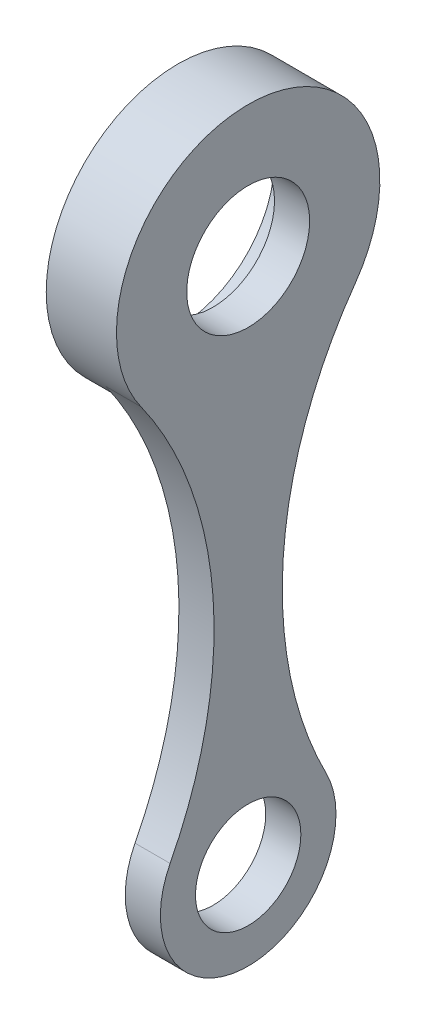
ISO-10303-21;
HEADER;
FILE_DESCRIPTION(('STEP AP214'),'2;1');
FILE_NAME('part.step','',(''),(''),'','','');
FILE_SCHEMA(('AUTOMOTIVE_DESIGN { 1 0 10303 214 1 1 1 1 }'));
ENDSEC;
DATA;
#1=APPLICATION_CONTEXT('core data for automotive mechanical design processes');
#2=APPLICATION_PROTOCOL_DEFINITION('international standard','automotive_design',2000,#1);
#3=PRODUCT_CONTEXT('',#1,'mechanical');
#4=PRODUCT('Part','Part','',(#3));
#5=PRODUCT_RELATED_PRODUCT_CATEGORY('part','',(#4));
#6=PRODUCT_DEFINITION_FORMATION('','',#4);
#7=PRODUCT_DEFINITION_CONTEXT('part definition',#1,'design');
#8=PRODUCT_DEFINITION('design','',#6,#7);
#9=PRODUCT_DEFINITION_SHAPE('','',#8);
#10=(LENGTH_UNIT() NAMED_UNIT(*) SI_UNIT(.MILLI.,.METRE.));
#11=(NAMED_UNIT(*) PLANE_ANGLE_UNIT() SI_UNIT($,.RADIAN.));
#12=(NAMED_UNIT(*) SI_UNIT($,.STERADIAN.) SOLID_ANGLE_UNIT());
#13=UNCERTAINTY_MEASURE_WITH_UNIT(LENGTH_MEASURE(1.E-05),#10,'distance_accuracy_value','');
#14=(GEOMETRIC_REPRESENTATION_CONTEXT(3) GLOBAL_UNCERTAINTY_ASSIGNED_CONTEXT((#13)) GLOBAL_UNIT_ASSIGNED_CONTEXT((#10,
#11,#12)) REPRESENTATION_CONTEXT('',''));
#15=CARTESIAN_POINT('',(0.,0.,0.));
#16=DIRECTION('',(0.,0.,1.));
#17=DIRECTION('',(1.,0.,0.));
#18=AXIS2_PLACEMENT_3D('',#15,#16,#17);
#19=CARTESIAN_POINT('',(0.,0.,0.));
#20=DIRECTION('',(1.,0.,0.));
#21=DIRECTION('',(0.,0.,-1.));
#22=AXIS2_PLACEMENT_3D('',#19,#20,#21);
#23=PLANE('',#22);
#24=CARTESIAN_POINT('',(0.,0.,0.));
#25=DIRECTION('',(1.,0.,0.));
#26=DIRECTION('',(0.,0.,-1.));
#27=AXIS2_PLACEMENT_3D('',#24,#25,#26);
#28=CIRCLE('',#27,17.5);
#29=CARTESIAN_POINT('',(0.,0.,-17.5));
#30=VERTEX_POINT('',#29);
#31=EDGE_CURVE('E105',#30,#30,#28,.T.);
#32=ORIENTED_EDGE('',*,*,#31,.T.);
#33=EDGE_LOOP('',(#32));
#34=FACE_BOUND('',#33,.T.);
#35=CARTESIAN_POINT('',(0.,0.,0.));
#36=DIRECTION('',(-1.,0.,0.));
#37=DIRECTION('',(0.,0.,1.));
#38=AXIS2_PLACEMENT_3D('',#35,#36,#37);
#39=CIRCLE('',#38,27.5);
#40=CARTESIAN_POINT('',(0.,0.,27.5));
#41=VERTEX_POINT('',#40);
#42=EDGE_CURVE('E246',#41,#41,#39,.T.);
#43=ORIENTED_EDGE('',*,*,#42,.T.);
#44=EDGE_LOOP('',(#43));
#45=FACE_BOUND('',#44,.T.);
#46=ADVANCED_FACE('F38',(#34,#45),#23,.F.);
#47=CARTESIAN_POINT('',(10.,-150.,0.));
#48=DIRECTION('',(-1.,0.,0.));
#49=DIRECTION('',(0.,0.,1.));
#50=AXIS2_PLACEMENT_3D('',#47,#48,#49);
#51=CYLINDRICAL_SURFACE('',#50,25.);
#52=CARTESIAN_POINT('',(0.,-150.,0.));
#53=DIRECTION('',(1.,0.,0.));
#54=DIRECTION('',(0.,0.,-1.));
#55=AXIS2_PLACEMENT_3D('',#52,#53,#54);
#56=CIRCLE('',#55,25.);
#57=CARTESIAN_POINT('',(0.,-138.545961777545,22.2217237944887));
#58=VERTEX_POINT('',#57);
#59=CARTESIAN_POINT('',(0.,-138.545961777545,-22.2217237944887));
#60=VERTEX_POINT('',#59);
#61=EDGE_CURVE('E103',#58,#60,#56,.T.);
#62=ORIENTED_EDGE('',*,*,#61,.T.);
#63=DIRECTION('',(-1.,0.,0.));
#64=VECTOR('',#63,1.);
#65=CARTESIAN_POINT('',(10.,-138.545961777545,-22.2217237944887));
#66=LINE('',#65,#64);
#67=CARTESIAN_POINT('',(10.,-138.545961777545,-22.2217237944887));
#68=VERTEX_POINT('',#67);
#69=EDGE_CURVE('E11',#68,#60,#66,.T.);
#70=ORIENTED_EDGE('',*,*,#69,.F.);
#71=CARTESIAN_POINT('',(10.,-150.,0.));
#72=DIRECTION('',(1.,0.,0.));
#73=DIRECTION('',(0.,0.,-1.));
#74=AXIS2_PLACEMENT_3D('',#71,#72,#73);
#75=CIRCLE('',#74,25.);
#76=CARTESIAN_POINT('',(10.,-138.545961777545,22.2217237944887));
#77=VERTEX_POINT('',#76);
#78=EDGE_CURVE('E80',#77,#68,#75,.T.);
#79=ORIENTED_EDGE('',*,*,#78,.F.);
#80=DIRECTION('',(-1.,0.,0.));
#81=VECTOR('',#80,1.);
#82=CARTESIAN_POINT('',(10.,-138.545961777545,22.2217237944887));
#83=LINE('',#82,#81);
#84=EDGE_CURVE('E115',#77,#58,#83,.T.);
#85=ORIENTED_EDGE('',*,*,#84,.T.);
#86=EDGE_LOOP('',(#62,#70,#79,#85));
#87=FACE_BOUND('',#86,.T.);
#88=ADVANCED_FACE('F40',(#87),#51,.T.);
#89=CARTESIAN_POINT('',(10.,-86.9828021443476,-122.258258428514));
#90=DIRECTION('',(-1.,0.,0.));
#91=DIRECTION('',(0.,0.,1.));
#92=AXIS2_PLACEMENT_3D('',#89,#90,#91);
#93=CYLINDRICAL_SURFACE('',#92,112.543625732172);
#94=CARTESIAN_POINT('',(0.,-86.9828021443476,-122.258258428514));
#95=DIRECTION('',(1.,0.,0.));
#96=DIRECTION('',(0.,0.,-1.));
#97=AXIS2_PLACEMENT_3D('',#94,#95,#96);
#98=CIRCLE('',#97,112.543625732172);
#99=CARTESIAN_POINT('',(0.,-21.7393778942363,-30.5556778483409));
#100=VERTEX_POINT('',#99);
#101=EDGE_CURVE('E90',#100,#60,#98,.T.);
#102=ORIENTED_EDGE('',*,*,#101,.F.);
#103=DIRECTION('',(-1.,0.,0.));
#104=VECTOR('',#103,1.);
#105=CARTESIAN_POINT('',(10.,-21.7393778942363,-30.5556778483409));
#106=LINE('',#105,#104);
#107=CARTESIAN_POINT('',(10.,-21.7393778942363,-30.5556778483409));
#108=VERTEX_POINT('',#107);
#109=EDGE_CURVE('E47',#108,#100,#106,.T.);
#110=ORIENTED_EDGE('',*,*,#109,.F.);
#111=CARTESIAN_POINT('',(10.,-86.9828021443476,-122.258258428514));
#112=DIRECTION('',(1.,0.,0.));
#113=DIRECTION('',(0.,0.,-1.));
#114=AXIS2_PLACEMENT_3D('',#111,#112,#113);
#115=CIRCLE('',#114,112.543625732172);
#116=EDGE_CURVE('E123',#108,#68,#115,.T.);
#117=ORIENTED_EDGE('',*,*,#116,.T.);
#118=ORIENTED_EDGE('',*,*,#69,.T.);
#119=EDGE_LOOP('',(#102,#110,#117,#118));
#120=FACE_BOUND('',#119,.T.);
#121=ADVANCED_FACE('F101',(#120),#93,.F.);
#122=CARTESIAN_POINT('',(10.,0.,0.));
#123=DIRECTION('',(-1.,0.,0.));
#124=DIRECTION('',(0.,0.,1.));
#125=AXIS2_PLACEMENT_3D('',#122,#123,#124);
#126=CYLINDRICAL_SURFACE('',#125,37.5);
#127=ORIENTED_EDGE('',*,*,#109,.T.);
#128=CARTESIAN_POINT('',(0.,0.,0.));
#129=DIRECTION('',(-1.,0.,0.));
#130=DIRECTION('',(0.,0.,1.));
#131=AXIS2_PLACEMENT_3D('',#128,#129,#130);
#132=CIRCLE('',#131,37.5);
#133=CARTESIAN_POINT('',(0.,-21.7393778942363,30.5556778483409));
#134=VERTEX_POINT('',#133);
#135=EDGE_CURVE('E69',#100,#134,#132,.T.);
#136=ORIENTED_EDGE('',*,*,#135,.T.);
#137=DIRECTION('',(-1.,0.,0.));
#138=VECTOR('',#137,1.);
#139=CARTESIAN_POINT('',(10.,-21.7393778942363,30.5556778483409));
#140=LINE('',#139,#138);
#141=CARTESIAN_POINT('',(10.,-21.7393778942363,30.5556778483409));
#142=VERTEX_POINT('',#141);
#143=EDGE_CURVE('E100',#142,#134,#140,.T.);
#144=ORIENTED_EDGE('',*,*,#143,.F.);
#145=CARTESIAN_POINT('',(10.,0.,0.));
#146=DIRECTION('',(1.,0.,0.));
#147=DIRECTION('',(0.,0.,-1.));
#148=AXIS2_PLACEMENT_3D('',#145,#146,#147);
#149=CIRCLE('',#148,37.5);
#150=EDGE_CURVE('E97',#108,#142,#149,.T.);
#151=ORIENTED_EDGE('',*,*,#150,.F.);
#152=EDGE_LOOP('',(#127,#136,#144,#151));
#153=FACE_BOUND('',#152,.T.);
#154=CARTESIAN_POINT('',(-10.,0.,0.));
#155=DIRECTION('',(-1.,0.,0.));
#156=DIRECTION('',(0.,0.,1.));
#157=AXIS2_PLACEMENT_3D('',#154,#155,#156);
#158=CIRCLE('',#157,37.5);
#159=CARTESIAN_POINT('',(-10.,0.,37.5));
#160=VERTEX_POINT('',#159);
#161=EDGE_CURVE('E91',#160,#160,#158,.T.);
#162=ORIENTED_EDGE('',*,*,#161,.F.);
#163=EDGE_LOOP('',(#162));
#164=FACE_BOUND('',#163,.T.);
#165=ADVANCED_FACE('F95',(#153,#164),#126,.T.);
#166=CARTESIAN_POINT('',(10.,0.,0.));
#167=DIRECTION('',(-1.,0.,0.));
#168=DIRECTION('',(0.,0.,1.));
#169=AXIS2_PLACEMENT_3D('',#166,#167,#168);
#170=CYLINDRICAL_SURFACE('',#169,17.5);
#171=CARTESIAN_POINT('',(10.,0.,0.));
#172=DIRECTION('',(1.,0.,0.));
#173=DIRECTION('',(0.,0.,-1.));
#174=AXIS2_PLACEMENT_3D('',#171,#172,#173);
#175=CIRCLE('',#174,17.5);
#176=CARTESIAN_POINT('',(10.,0.,-17.5));
#177=VERTEX_POINT('',#176);
#178=EDGE_CURVE('E119',#177,#177,#175,.T.);
#179=ORIENTED_EDGE('',*,*,#178,.T.);
#180=EDGE_LOOP('',(#179));
#181=FACE_BOUND('',#180,.T.);
#182=ORIENTED_EDGE('',*,*,#31,.F.);
#183=EDGE_LOOP('',(#182));
#184=FACE_BOUND('',#183,.T.);
#185=ADVANCED_FACE('F152',(#181,#184),#170,.F.);
#186=CARTESIAN_POINT('',(10.,-86.9828021443476,122.258258428514));
#187=DIRECTION('',(-1.,0.,0.));
#188=DIRECTION('',(0.,0.,1.));
#189=AXIS2_PLACEMENT_3D('',#186,#187,#188);
#190=CYLINDRICAL_SURFACE('',#189,112.543625732172);
#191=CARTESIAN_POINT('',(0.,-86.9828021443476,122.258258428514));
#192=DIRECTION('',(1.,0.,0.));
#193=DIRECTION('',(0.,0.,-1.));
#194=AXIS2_PLACEMENT_3D('',#191,#192,#193);
#195=CIRCLE('',#194,112.543625732172);
#196=EDGE_CURVE('E75',#134,#58,#195,.F.);
#197=ORIENTED_EDGE('',*,*,#196,.T.);
#198=ORIENTED_EDGE('',*,*,#84,.F.);
#199=CARTESIAN_POINT('',(10.,-86.9828021443476,122.258258428514));
#200=DIRECTION('',(1.,0.,0.));
#201=DIRECTION('',(0.,0.,-1.));
#202=AXIS2_PLACEMENT_3D('',#199,#200,#201);
#203=CIRCLE('',#202,112.543625732172);
#204=EDGE_CURVE('E55',#142,#77,#203,.F.);
#205=ORIENTED_EDGE('',*,*,#204,.F.);
#206=ORIENTED_EDGE('',*,*,#143,.T.);
#207=EDGE_LOOP('',(#197,#198,#205,#206));
#208=FACE_BOUND('',#207,.T.);
#209=ADVANCED_FACE('F118',(#208),#190,.F.);
#210=CARTESIAN_POINT('',(10.,-150.,0.));
#211=DIRECTION('',(-1.,0.,0.));
#212=DIRECTION('',(0.,0.,1.));
#213=AXIS2_PLACEMENT_3D('',#210,#211,#212);
#214=CYLINDRICAL_SURFACE('',#213,15.);
#215=CARTESIAN_POINT('',(10.,-150.,0.));
#216=DIRECTION('',(1.,0.,0.));
#217=DIRECTION('',(0.,0.,-1.));
#218=AXIS2_PLACEMENT_3D('',#215,#216,#217);
#219=CIRCLE('',#218,15.);
#220=CARTESIAN_POINT('',(10.,-150.,-15.));
#221=VERTEX_POINT('',#220);
#222=EDGE_CURVE('E117',#221,#221,#219,.T.);
#223=ORIENTED_EDGE('',*,*,#222,.T.);
#224=EDGE_LOOP('',(#223));
#225=FACE_BOUND('',#224,.T.);
#226=CARTESIAN_POINT('',(0.,-150.,0.));
#227=DIRECTION('',(1.,0.,0.));
#228=DIRECTION('',(0.,0.,-1.));
#229=AXIS2_PLACEMENT_3D('',#226,#227,#228);
#230=CIRCLE('',#229,15.);
#231=CARTESIAN_POINT('',(0.,-150.,-15.));
#232=VERTEX_POINT('',#231);
#233=EDGE_CURVE('E112',#232,#232,#230,.T.);
#234=ORIENTED_EDGE('',*,*,#233,.F.);
#235=EDGE_LOOP('',(#234));
#236=FACE_BOUND('',#235,.T.);
#237=ADVANCED_FACE('F129',(#225,#236),#214,.F.);
#238=CARTESIAN_POINT('',(10.,0.,0.));
#239=DIRECTION('',(1.,0.,0.));
#240=DIRECTION('',(0.,0.,-1.));
#241=AXIS2_PLACEMENT_3D('',#238,#239,#240);
#242=PLANE('',#241);
#243=ORIENTED_EDGE('',*,*,#78,.T.);
#244=ORIENTED_EDGE('',*,*,#116,.F.);
#245=ORIENTED_EDGE('',*,*,#150,.T.);
#246=ORIENTED_EDGE('',*,*,#204,.T.);
#247=EDGE_LOOP('',(#243,#244,#245,#246));
#248=FACE_BOUND('',#247,.T.);
#249=ORIENTED_EDGE('',*,*,#178,.F.);
#250=EDGE_LOOP('',(#249));
#251=FACE_BOUND('',#250,.T.);
#252=ORIENTED_EDGE('',*,*,#222,.F.);
#253=EDGE_LOOP('',(#252));
#254=FACE_BOUND('',#253,.T.);
#255=ADVANCED_FACE('F132',(#248,#251,#254),#242,.T.);
#256=ORIENTED_EDGE('',*,*,#135,.F.);
#257=ORIENTED_EDGE('',*,*,#101,.T.);
#258=ORIENTED_EDGE('',*,*,#61,.F.);
#259=ORIENTED_EDGE('',*,*,#196,.F.);
#260=EDGE_LOOP('',(#256,#257,#258,#259));
#261=FACE_BOUND('',#260,.T.);
#262=ORIENTED_EDGE('',*,*,#233,.T.);
#263=EDGE_LOOP('',(#262));
#264=FACE_BOUND('',#263,.T.);
#265=ADVANCED_FACE('F86',(#261,#264),#23,.F.);
#266=CARTESIAN_POINT('',(-10.,0.,0.));
#267=DIRECTION('',(-1.,0.,0.));
#268=DIRECTION('',(0.,0.,1.));
#269=AXIS2_PLACEMENT_3D('',#266,#267,#268);
#270=PLANE('',#269);
#271=ORIENTED_EDGE('',*,*,#161,.T.);
#272=EDGE_LOOP('',(#271));
#273=FACE_BOUND('',#272,.T.);
#274=CARTESIAN_POINT('',(-10.,0.,0.));
#275=DIRECTION('',(-1.,0.,0.));
#276=DIRECTION('',(0.,0.,1.));
#277=AXIS2_PLACEMENT_3D('',#274,#275,#276);
#278=CIRCLE('',#277,27.5);
#279=CARTESIAN_POINT('',(-10.,0.,27.5));
#280=VERTEX_POINT('',#279);
#281=EDGE_CURVE('E92',#280,#280,#278,.T.);
#282=ORIENTED_EDGE('',*,*,#281,.F.);
#283=EDGE_LOOP('',(#282));
#284=FACE_BOUND('',#283,.T.);
#285=ADVANCED_FACE('F139',(#273,#284),#270,.T.);
#286=CARTESIAN_POINT('',(-10.,0.,0.));
#287=DIRECTION('',(1.,0.,0.));
#288=DIRECTION('',(0.,0.,-1.));
#289=AXIS2_PLACEMENT_3D('',#286,#287,#288);
#290=CYLINDRICAL_SURFACE('',#289,27.5);
#291=ORIENTED_EDGE('',*,*,#281,.T.);
#292=EDGE_LOOP('',(#291));
#293=FACE_BOUND('',#292,.T.);
#294=ORIENTED_EDGE('',*,*,#42,.F.);
#295=EDGE_LOOP('',(#294));
#296=FACE_BOUND('',#295,.T.);
#297=ADVANCED_FACE('F211',(#293,#296),#290,.F.);
#298=CLOSED_SHELL('',(#46,#88,#121,#165,#185,#209,#237,#255,#265,#285,#297));
#299=MANIFOLD_SOLID_BREP('B2',#298);
#300=ADVANCED_BREP_SHAPE_REPRESENTATION('',(#18,#299),#14);
#301=SHAPE_DEFINITION_REPRESENTATION(#9,#300);
ENDSEC;
END-ISO-10303-21;
